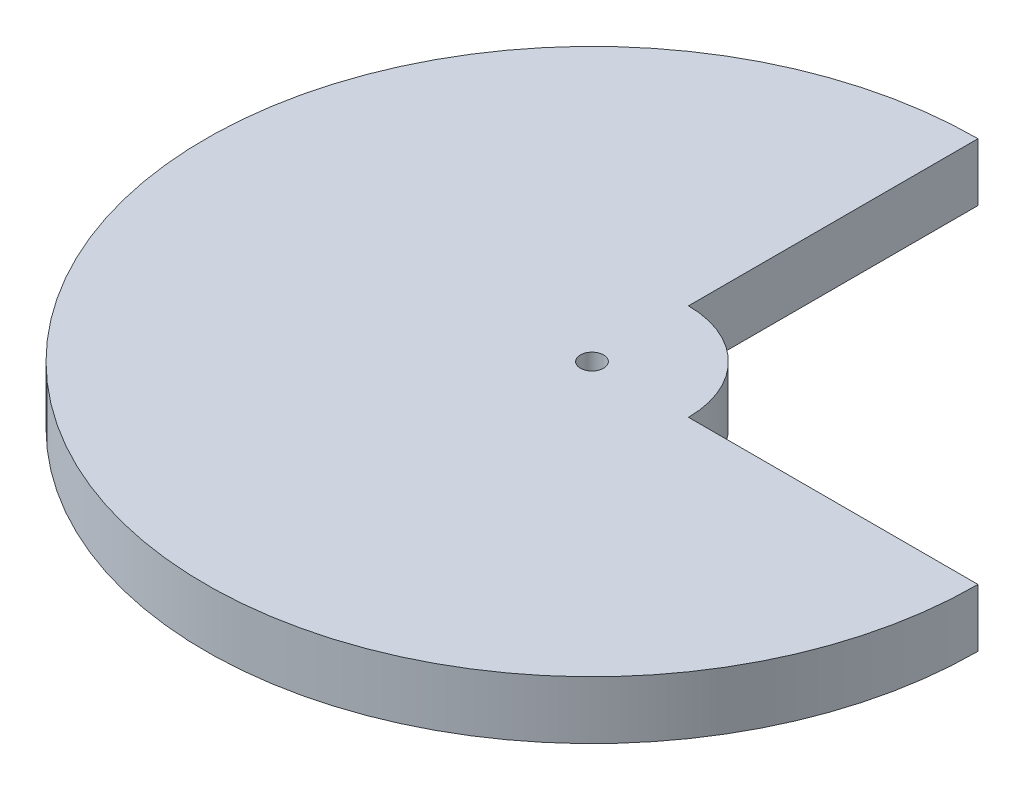
ISO-10303-21;
HEADER;
FILE_DESCRIPTION(('STEP AP214'),'2;1');
FILE_NAME('part.step','',(''),(''),'','','');
FILE_SCHEMA(('AUTOMOTIVE_DESIGN { 1 0 10303 214 1 1 1 1 }'));
ENDSEC;
DATA;
#1=APPLICATION_CONTEXT('core data for automotive mechanical design processes');
#2=APPLICATION_PROTOCOL_DEFINITION('international standard','automotive_design',2000,#1);
#3=PRODUCT_CONTEXT('',#1,'mechanical');
#4=PRODUCT('Part','Part','',(#3));
#5=PRODUCT_RELATED_PRODUCT_CATEGORY('part','',(#4));
#6=PRODUCT_DEFINITION_FORMATION('','',#4);
#7=PRODUCT_DEFINITION_CONTEXT('part definition',#1,'design');
#8=PRODUCT_DEFINITION('design','',#6,#7);
#9=PRODUCT_DEFINITION_SHAPE('','',#8);
#10=(LENGTH_UNIT() NAMED_UNIT(*) SI_UNIT(.MILLI.,.METRE.));
#11=(NAMED_UNIT(*) PLANE_ANGLE_UNIT() SI_UNIT($,.RADIAN.));
#12=(NAMED_UNIT(*) SI_UNIT($,.STERADIAN.) SOLID_ANGLE_UNIT());
#13=UNCERTAINTY_MEASURE_WITH_UNIT(LENGTH_MEASURE(1.E-05),#10,'distance_accuracy_value','');
#14=(GEOMETRIC_REPRESENTATION_CONTEXT(3) GLOBAL_UNCERTAINTY_ASSIGNED_CONTEXT((#13)) GLOBAL_UNIT_ASSIGNED_CONTEXT((#10,
#11,#12)) REPRESENTATION_CONTEXT('',''));
#15=CARTESIAN_POINT('',(0.,0.,0.));
#16=DIRECTION('',(0.,0.,1.));
#17=DIRECTION('',(1.,0.,0.));
#18=AXIS2_PLACEMENT_3D('',#15,#16,#17);
#19=CARTESIAN_POINT('',(0.,3.,0.));
#20=DIRECTION('',(0.,1.,0.));
#21=DIRECTION('',(0.,0.,1.));
#22=AXIS2_PLACEMENT_3D('',#19,#20,#21);
#23=PLANE('',#22);
#24=CARTESIAN_POINT('',(0.,3.,0.));
#25=DIRECTION('',(0.,1.,0.));
#26=DIRECTION('',(0.,0.,1.));
#27=AXIS2_PLACEMENT_3D('',#24,#25,#26);
#28=CIRCLE('',#27,5.);
#29=CARTESIAN_POINT('',(5.,3.,0.));
#30=VERTEX_POINT('',#29);
#31=CARTESIAN_POINT('',(0.,3.,-5.));
#32=VERTEX_POINT('',#31);
#33=EDGE_CURVE('E87',#30,#32,#28,.T.);
#34=ORIENTED_EDGE('',*,*,#33,.T.);
#35=DIRECTION('',(0.,0.,-1.));
#36=VECTOR('',#35,1.);
#37=CARTESIAN_POINT('',(0.,3.,-5.));
#38=LINE('',#37,#36);
#39=CARTESIAN_POINT('',(0.,3.,-20.));
#40=VERTEX_POINT('',#39);
#41=EDGE_CURVE('E82',#32,#40,#38,.T.);
#42=ORIENTED_EDGE('',*,*,#41,.T.);
#43=CARTESIAN_POINT('',(0.,3.,0.));
#44=DIRECTION('',(0.,1.,0.));
#45=DIRECTION('',(0.,0.,1.));
#46=AXIS2_PLACEMENT_3D('',#43,#44,#45);
#47=CIRCLE('',#46,20.);
#48=CARTESIAN_POINT('',(20.,3.,0.));
#49=VERTEX_POINT('',#48);
#50=EDGE_CURVE('E85',#40,#49,#47,.T.);
#51=ORIENTED_EDGE('',*,*,#50,.T.);
#52=DIRECTION('',(-1.,0.,0.));
#53=VECTOR('',#52,1.);
#54=CARTESIAN_POINT('',(20.,3.,0.));
#55=LINE('',#54,#53);
#56=EDGE_CURVE('E52',#49,#30,#55,.T.);
#57=ORIENTED_EDGE('',*,*,#56,.T.);
#58=EDGE_LOOP('',(#34,#42,#51,#57));
#59=FACE_BOUND('',#58,.T.);
#60=CARTESIAN_POINT('',(0.,3.,0.));
#61=DIRECTION('',(0.,1.,0.));
#62=DIRECTION('',(0.,0.,1.));
#63=AXIS2_PLACEMENT_3D('',#60,#61,#62);
#64=CIRCLE('',#63,0.6);
#65=CARTESIAN_POINT('',(0.,3.,0.6));
#66=VERTEX_POINT('',#65);
#67=EDGE_CURVE('E102',#66,#66,#64,.T.);
#68=ORIENTED_EDGE('',*,*,#67,.F.);
#69=EDGE_LOOP('',(#68));
#70=FACE_BOUND('',#69,.T.);
#71=ADVANCED_FACE('F35',(#59,#70),#23,.T.);
#72=CARTESIAN_POINT('',(0.,0.,0.));
#73=DIRECTION('',(0.,1.,0.));
#74=DIRECTION('',(0.,0.,1.));
#75=AXIS2_PLACEMENT_3D('',#72,#73,#74);
#76=PLANE('',#75);
#77=CARTESIAN_POINT('',(0.,0.,0.));
#78=DIRECTION('',(0.,1.,0.));
#79=DIRECTION('',(0.,0.,1.));
#80=AXIS2_PLACEMENT_3D('',#77,#78,#79);
#81=CIRCLE('',#80,5.);
#82=CARTESIAN_POINT('',(5.,0.,0.));
#83=VERTEX_POINT('',#82);
#84=CARTESIAN_POINT('',(0.,0.,-5.));
#85=VERTEX_POINT('',#84);
#86=EDGE_CURVE('E99',#83,#85,#81,.T.);
#87=ORIENTED_EDGE('',*,*,#86,.F.);
#88=DIRECTION('',(-1.,0.,0.));
#89=VECTOR('',#88,1.);
#90=CARTESIAN_POINT('',(20.,0.,0.));
#91=LINE('',#90,#89);
#92=CARTESIAN_POINT('',(20.,0.,0.));
#93=VERTEX_POINT('',#92);
#94=EDGE_CURVE('E75',#93,#83,#91,.T.);
#95=ORIENTED_EDGE('',*,*,#94,.F.);
#96=CARTESIAN_POINT('',(0.,0.,0.));
#97=DIRECTION('',(0.,1.,0.));
#98=DIRECTION('',(0.,0.,1.));
#99=AXIS2_PLACEMENT_3D('',#96,#97,#98);
#100=CIRCLE('',#99,20.);
#101=CARTESIAN_POINT('',(0.,0.,-20.));
#102=VERTEX_POINT('',#101);
#103=EDGE_CURVE('E69',#102,#93,#100,.T.);
#104=ORIENTED_EDGE('',*,*,#103,.F.);
#105=DIRECTION('',(0.,0.,-1.));
#106=VECTOR('',#105,1.);
#107=CARTESIAN_POINT('',(0.,0.,-5.));
#108=LINE('',#107,#106);
#109=EDGE_CURVE('E91',#85,#102,#108,.T.);
#110=ORIENTED_EDGE('',*,*,#109,.F.);
#111=EDGE_LOOP('',(#87,#95,#104,#110));
#112=FACE_BOUND('',#111,.T.);
#113=CARTESIAN_POINT('',(0.,0.,0.));
#114=DIRECTION('',(0.,1.,0.));
#115=DIRECTION('',(0.,0.,1.));
#116=AXIS2_PLACEMENT_3D('',#113,#114,#115);
#117=CIRCLE('',#116,0.6);
#118=CARTESIAN_POINT('',(0.,0.,0.6));
#119=VERTEX_POINT('',#118);
#120=EDGE_CURVE('E114',#119,#119,#117,.T.);
#121=ORIENTED_EDGE('',*,*,#120,.T.);
#122=EDGE_LOOP('',(#121));
#123=FACE_BOUND('',#122,.T.);
#124=ADVANCED_FACE('F110',(#112,#123),#76,.F.);
#125=CARTESIAN_POINT('',(0.,3.,0.));
#126=DIRECTION('',(0.,-1.,0.));
#127=DIRECTION('',(0.,0.,-1.));
#128=AXIS2_PLACEMENT_3D('',#125,#126,#127);
#129=CYLINDRICAL_SURFACE('',#128,5.);
#130=ORIENTED_EDGE('',*,*,#86,.T.);
#131=DIRECTION('',(0.,-1.,0.));
#132=VECTOR('',#131,1.);
#133=CARTESIAN_POINT('',(0.,3.,-5.));
#134=LINE('',#133,#132);
#135=EDGE_CURVE('E11',#32,#85,#134,.T.);
#136=ORIENTED_EDGE('',*,*,#135,.F.);
#137=ORIENTED_EDGE('',*,*,#33,.F.);
#138=DIRECTION('',(0.,-1.,0.));
#139=VECTOR('',#138,1.);
#140=CARTESIAN_POINT('',(5.,3.,0.));
#141=LINE('',#140,#139);
#142=EDGE_CURVE('E95',#30,#83,#141,.T.);
#143=ORIENTED_EDGE('',*,*,#142,.T.);
#144=EDGE_LOOP('',(#130,#136,#137,#143));
#145=FACE_BOUND('',#144,.T.);
#146=ADVANCED_FACE('F37',(#145),#129,.T.);
#147=CARTESIAN_POINT('',(0.,3.,-5.));
#148=DIRECTION('',(-1.,0.,0.));
#149=DIRECTION('',(0.,0.,1.));
#150=AXIS2_PLACEMENT_3D('',#147,#148,#149);
#151=PLANE('',#150);
#152=ORIENTED_EDGE('',*,*,#109,.T.);
#153=DIRECTION('',(0.,-1.,0.));
#154=VECTOR('',#153,1.);
#155=CARTESIAN_POINT('',(0.,3.,-20.));
#156=LINE('',#155,#154);
#157=EDGE_CURVE('E44',#40,#102,#156,.T.);
#158=ORIENTED_EDGE('',*,*,#157,.F.);
#159=ORIENTED_EDGE('',*,*,#41,.F.);
#160=ORIENTED_EDGE('',*,*,#135,.T.);
#161=EDGE_LOOP('',(#152,#158,#159,#160));
#162=FACE_BOUND('',#161,.T.);
#163=ADVANCED_FACE('F90',(#162),#151,.F.);
#164=CARTESIAN_POINT('',(0.,3.,0.));
#165=DIRECTION('',(0.,-1.,0.));
#166=DIRECTION('',(0.,0.,-1.));
#167=AXIS2_PLACEMENT_3D('',#164,#165,#166);
#168=CYLINDRICAL_SURFACE('',#167,20.);
#169=ORIENTED_EDGE('',*,*,#103,.T.);
#170=DIRECTION('',(0.,-1.,0.));
#171=VECTOR('',#170,1.);
#172=CARTESIAN_POINT('',(20.,3.,0.));
#173=LINE('',#172,#171);
#174=EDGE_CURVE('E92',#49,#93,#173,.T.);
#175=ORIENTED_EDGE('',*,*,#174,.F.);
#176=ORIENTED_EDGE('',*,*,#50,.F.);
#177=ORIENTED_EDGE('',*,*,#157,.T.);
#178=EDGE_LOOP('',(#169,#175,#176,#177));
#179=FACE_BOUND('',#178,.T.);
#180=ADVANCED_FACE('F93',(#179),#168,.T.);
#181=CARTESIAN_POINT('',(20.,3.,0.));
#182=DIRECTION('',(0.,0.,1.));
#183=DIRECTION('',(1.,0.,0.));
#184=AXIS2_PLACEMENT_3D('',#181,#182,#183);
#185=PLANE('',#184);
#186=ORIENTED_EDGE('',*,*,#94,.T.);
#187=ORIENTED_EDGE('',*,*,#142,.F.);
#188=ORIENTED_EDGE('',*,*,#56,.F.);
#189=ORIENTED_EDGE('',*,*,#174,.T.);
#190=EDGE_LOOP('',(#186,#187,#188,#189));
#191=FACE_BOUND('',#190,.T.);
#192=ADVANCED_FACE('F107',(#191),#185,.F.);
#193=CARTESIAN_POINT('',(0.,3.,0.));
#194=DIRECTION('',(0.,-1.,0.));
#195=DIRECTION('',(0.,0.,-1.));
#196=AXIS2_PLACEMENT_3D('',#193,#194,#195);
#197=CYLINDRICAL_SURFACE('',#196,0.6);
#198=ORIENTED_EDGE('',*,*,#67,.T.);
#199=EDGE_LOOP('',(#198));
#200=FACE_BOUND('',#199,.T.);
#201=ORIENTED_EDGE('',*,*,#120,.F.);
#202=EDGE_LOOP('',(#201));
#203=FACE_BOUND('',#202,.T.);
#204=ADVANCED_FACE('F120',(#200,#203),#197,.F.);
#205=CLOSED_SHELL('',(#71,#124,#146,#163,#180,#192,#204));
#206=MANIFOLD_SOLID_BREP('B2',#205);
#207=ADVANCED_BREP_SHAPE_REPRESENTATION('',(#18,#206),#14);
#208=SHAPE_DEFINITION_REPRESENTATION(#9,#207);
ENDSEC;
END-ISO-10303-21;
